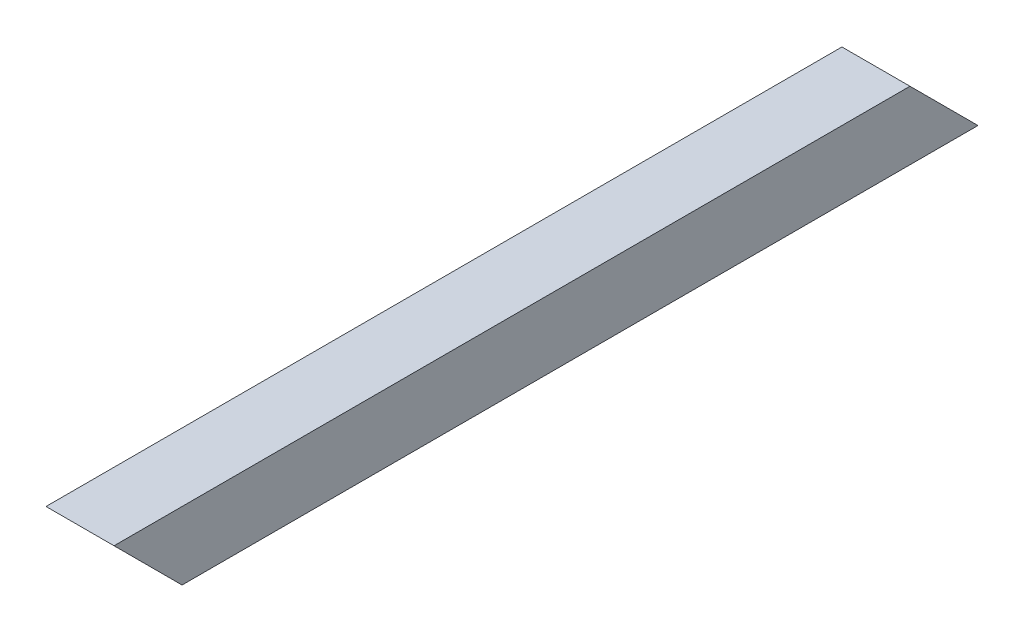
ISO-10303-21;
HEADER;
FILE_DESCRIPTION(('STEP AP214'),'2;1');
FILE_NAME('part.step','',(''),(''),'','','');
FILE_SCHEMA(('AUTOMOTIVE_DESIGN { 1 0 10303 214 1 1 1 1 }'));
ENDSEC;
DATA;
#1=APPLICATION_CONTEXT('core data for automotive mechanical design processes');
#2=APPLICATION_PROTOCOL_DEFINITION('international standard','automotive_design',2000,#1);
#3=PRODUCT_CONTEXT('',#1,'mechanical');
#4=PRODUCT('Part','Part','',(#3));
#5=PRODUCT_RELATED_PRODUCT_CATEGORY('part','',(#4));
#6=PRODUCT_DEFINITION_FORMATION('','',#4);
#7=PRODUCT_DEFINITION_CONTEXT('part definition',#1,'design');
#8=PRODUCT_DEFINITION('design','',#6,#7);
#9=PRODUCT_DEFINITION_SHAPE('','',#8);
#10=(LENGTH_UNIT() NAMED_UNIT(*) SI_UNIT(.MILLI.,.METRE.));
#11=(NAMED_UNIT(*) PLANE_ANGLE_UNIT() SI_UNIT($,.RADIAN.));
#12=(NAMED_UNIT(*) SI_UNIT($,.STERADIAN.) SOLID_ANGLE_UNIT());
#13=UNCERTAINTY_MEASURE_WITH_UNIT(LENGTH_MEASURE(1.E-05),#10,'distance_accuracy_value','');
#14=(GEOMETRIC_REPRESENTATION_CONTEXT(3) GLOBAL_UNCERTAINTY_ASSIGNED_CONTEXT((#13)) GLOBAL_UNIT_ASSIGNED_CONTEXT((#10,
#11,#12)) REPRESENTATION_CONTEXT('',''));
#15=CARTESIAN_POINT('',(0.,0.,0.));
#16=DIRECTION('',(0.,0.,1.));
#17=DIRECTION('',(1.,0.,0.));
#18=AXIS2_PLACEMENT_3D('',#15,#16,#17);
#19=CARTESIAN_POINT('',(-15.4655819438556,10.9459197691443,322.58));
#20=DIRECTION('',(1.,0.,0.));
#21=DIRECTION('',(0.,1.,0.));
#22=AXIS2_PLACEMENT_3D('',#19,#20,#21);
#23=PLANE('',#22);
#24=DIRECTION('',(0.,0.,-1.));
#25=VECTOR('',#24,1.);
#26=CARTESIAN_POINT('',(-15.4655819438556,10.9459197691443,322.58));
#27=LINE('',#26,#25);
#28=CARTESIAN_POINT('',(-15.4655819438556,10.9459197691443,322.58));
#29=VERTEX_POINT('',#28);
#30=CARTESIAN_POINT('',(-15.4655819438556,10.9459197691443,25.3999999999997));
#31=VERTEX_POINT('',#30);
#32=EDGE_CURVE('E120',#29,#31,#27,.T.);
#33=ORIENTED_EDGE('',*,*,#32,.T.);
#34=DIRECTION('',(0.,0.707106781186552,0.707106781186543));
#35=VECTOR('',#34,1.);
#36=CARTESIAN_POINT('',(-15.4655819438556,-14.4540802308557,0.));
#37=LINE('',#36,#35);
#38=CARTESIAN_POINT('',(-15.4655819438556,-14.4540802308557,0.));
#39=VERTEX_POINT('',#38);
#40=EDGE_CURVE('E47',#39,#31,#37,.T.);
#41=ORIENTED_EDGE('',*,*,#40,.F.);
#42=DIRECTION('',(0.,0.,-1.));
#43=VECTOR('',#42,1.);
#44=CARTESIAN_POINT('',(-15.4655819438556,-14.4540802308557,322.58));
#45=LINE('',#44,#43);
#46=CARTESIAN_POINT('',(-15.4655819438556,-14.4540802308557,297.18));
#47=VERTEX_POINT('',#46);
#48=EDGE_CURVE('E111',#47,#39,#45,.T.);
#49=ORIENTED_EDGE('',*,*,#48,.F.);
#50=DIRECTION('',(0.,-0.707106781186546,-0.707106781186549));
#51=VECTOR('',#50,1.);
#52=CARTESIAN_POINT('',(-15.4655819438556,10.9459197691443,322.58));
#53=LINE('',#52,#51);
#54=EDGE_CURVE('E161',#29,#47,#53,.T.);
#55=ORIENTED_EDGE('',*,*,#54,.F.);
#56=EDGE_LOOP('',(#33,#41,#49,#55));
#57=FACE_BOUND('',#56,.T.);
#58=ADVANCED_FACE('F33',(#57),#23,.F.);
#59=CARTESIAN_POINT('',(-15.4655819438556,-14.4540802308557,322.58));
#60=DIRECTION('',(0.,1.,0.));
#61=DIRECTION('',(0.,0.,1.));
#62=AXIS2_PLACEMENT_3D('',#59,#60,#61);
#63=PLANE('',#62);
#64=DIRECTION('',(0.,0.,-1.));
#65=VECTOR('',#64,1.);
#66=CARTESIAN_POINT('',(9.93441805614439,-14.4540802308557,322.58));
#67=LINE('',#66,#65);
#68=CARTESIAN_POINT('',(9.93441805614437,-14.4540802308557,297.18));
#69=VERTEX_POINT('',#68);
#70=CARTESIAN_POINT('',(9.93441805614439,-14.4540802308557,0.));
#71=VERTEX_POINT('',#70);
#72=EDGE_CURVE('E106',#69,#71,#67,.T.);
#73=ORIENTED_EDGE('',*,*,#72,.F.);
#74=DIRECTION('',(-1.,0.,0.));
#75=VECTOR('',#74,1.);
#76=CARTESIAN_POINT('',(284.254418056144,-14.4540802308556,297.18));
#77=LINE('',#76,#75);
#78=EDGE_CURVE('E149',#69,#47,#77,.T.);
#79=ORIENTED_EDGE('',*,*,#78,.T.);
#80=ORIENTED_EDGE('',*,*,#48,.T.);
#81=DIRECTION('',(1.,0.,0.));
#82=VECTOR('',#81,1.);
#83=CARTESIAN_POINT('',(-15.4655819438556,-14.4540802308557,0.));
#84=LINE('',#83,#82);
#85=EDGE_CURVE('E98',#39,#71,#84,.T.);
#86=ORIENTED_EDGE('',*,*,#85,.T.);
#87=EDGE_LOOP('',(#73,#79,#80,#86));
#88=FACE_BOUND('',#87,.T.);
#89=ADVANCED_FACE('F115',(#88),#63,.F.);
#90=CARTESIAN_POINT('',(9.93441805614439,10.9459197691443,322.58));
#91=DIRECTION('',(-1.,0.,0.));
#92=DIRECTION('',(0.,-1.,0.));
#93=AXIS2_PLACEMENT_3D('',#90,#91,#92);
#94=PLANE('',#93);
#95=ORIENTED_EDGE('',*,*,#72,.T.);
#96=DIRECTION('',(0.,0.707106781186552,0.707106781186543));
#97=VECTOR('',#96,1.);
#98=CARTESIAN_POINT('',(9.93441805614439,-14.4540802308557,0.));
#99=LINE('',#98,#97);
#100=CARTESIAN_POINT('',(9.93441805614439,10.9459197691443,25.3999999999997));
#101=VERTEX_POINT('',#100);
#102=EDGE_CURVE('E94',#71,#101,#99,.T.);
#103=ORIENTED_EDGE('',*,*,#102,.T.);
#104=DIRECTION('',(0.,0.,-1.));
#105=VECTOR('',#104,1.);
#106=CARTESIAN_POINT('',(9.93441805614439,10.9459197691443,322.58));
#107=LINE('',#106,#105);
#108=CARTESIAN_POINT('',(9.93441805614439,10.9459197691443,322.58));
#109=VERTEX_POINT('',#108);
#110=EDGE_CURVE('E112',#109,#101,#107,.T.);
#111=ORIENTED_EDGE('',*,*,#110,.F.);
#112=DIRECTION('',(0.,-0.707106781186546,-0.707106781186549));
#113=VECTOR('',#112,1.);
#114=CARTESIAN_POINT('',(9.93441805614439,10.9459197691443,322.58));
#115=LINE('',#114,#113);
#116=EDGE_CURVE('E108',#109,#69,#115,.T.);
#117=ORIENTED_EDGE('',*,*,#116,.T.);
#118=EDGE_LOOP('',(#95,#103,#111,#117));
#119=FACE_BOUND('',#118,.T.);
#120=ADVANCED_FACE('F107',(#119),#94,.F.);
#121=CARTESIAN_POINT('',(-15.4655819438556,10.9459197691443,322.58));
#122=DIRECTION('',(0.,-1.,0.));
#123=DIRECTION('',(0.,0.,-1.));
#124=AXIS2_PLACEMENT_3D('',#121,#122,#123);
#125=PLANE('',#124);
#126=ORIENTED_EDGE('',*,*,#110,.T.);
#127=DIRECTION('',(-1.,0.,0.));
#128=VECTOR('',#127,1.);
#129=CARTESIAN_POINT('',(9.93441805614439,10.9459197691443,25.3999999999997));
#130=LINE('',#129,#128);
#131=EDGE_CURVE('E99',#101,#31,#130,.T.);
#132=ORIENTED_EDGE('',*,*,#131,.T.);
#133=ORIENTED_EDGE('',*,*,#32,.F.);
#134=DIRECTION('',(-1.,0.,0.));
#135=VECTOR('',#134,1.);
#136=CARTESIAN_POINT('',(-15.4655819438556,10.9459197691443,322.58));
#137=LINE('',#136,#135);
#138=EDGE_CURVE('E117',#109,#29,#137,.T.);
#139=ORIENTED_EDGE('',*,*,#138,.F.);
#140=EDGE_LOOP('',(#126,#132,#133,#139));
#141=FACE_BOUND('',#140,.T.);
#142=ADVANCED_FACE('F171',(#141),#125,.F.);
#143=CARTESIAN_POINT('',(-12.2905819438556,7.77091976914433,322.58));
#144=DIRECTION('',(1.,0.,0.));
#145=DIRECTION('',(0.,1.,0.));
#146=AXIS2_PLACEMENT_3D('',#143,#144,#145);
#147=PLANE('',#146);
#148=DIRECTION('',(0.,-0.707106781186552,-0.707106781186543));
#149=VECTOR('',#148,1.);
#150=CARTESIAN_POINT('',(-12.2905819438556,157.948419769144,172.402499999998));
#151=LINE('',#150,#149);
#152=CARTESIAN_POINT('',(-12.2905819438556,7.77091976914433,22.2249999999997));
#153=VERTEX_POINT('',#152);
#154=CARTESIAN_POINT('',(-12.2905819438556,-11.2790802308557,3.17499999999993));
#155=VERTEX_POINT('',#154);
#156=EDGE_CURVE('E163',#153,#155,#151,.T.);
#157=ORIENTED_EDGE('',*,*,#156,.F.);
#158=DIRECTION('',(0.,0.,-1.));
#159=VECTOR('',#158,1.);
#160=CARTESIAN_POINT('',(-12.2905819438556,7.77091976914433,322.58));
#161=LINE('',#160,#159);
#162=CARTESIAN_POINT('',(-12.2905819438556,7.77091976914433,319.405));
#163=VERTEX_POINT('',#162);
#164=EDGE_CURVE('E152',#163,#153,#161,.T.);
#165=ORIENTED_EDGE('',*,*,#164,.F.);
#166=DIRECTION('',(0.,0.707106781186546,0.707106781186549));
#167=VECTOR('',#166,1.);
#168=CARTESIAN_POINT('',(-12.2905819438556,9.35841976914434,320.9925));
#169=LINE('',#168,#167);
#170=CARTESIAN_POINT('',(-12.2905819438556,-11.2790802308557,300.355));
#171=VERTEX_POINT('',#170);
#172=EDGE_CURVE('E137',#171,#163,#169,.T.);
#173=ORIENTED_EDGE('',*,*,#172,.F.);
#174=DIRECTION('',(0.,0.,-1.));
#175=VECTOR('',#174,1.);
#176=CARTESIAN_POINT('',(-12.2905819438556,-11.2790802308557,322.58));
#177=LINE('',#176,#175);
#178=EDGE_CURVE('E118',#171,#155,#177,.T.);
#179=ORIENTED_EDGE('',*,*,#178,.T.);
#180=EDGE_LOOP('',(#157,#165,#173,#179));
#181=FACE_BOUND('',#180,.T.);
#182=ADVANCED_FACE('F194',(#181),#147,.T.);
#183=CARTESIAN_POINT('',(-12.2905819438556,-11.2790802308557,322.58));
#184=DIRECTION('',(0.,1.,0.));
#185=DIRECTION('',(0.,0.,1.));
#186=AXIS2_PLACEMENT_3D('',#183,#184,#185);
#187=PLANE('',#186);
#188=DIRECTION('',(1.,0.,0.));
#189=VECTOR('',#188,1.);
#190=CARTESIAN_POINT('',(-12.2905819438557,-11.2790802308557,3.17499999999993));
#191=LINE('',#190,#189);
#192=CARTESIAN_POINT('',(6.7594180561444,-11.2790802308557,3.17500000000001));
#193=VERTEX_POINT('',#192);
#194=EDGE_CURVE('E165',#155,#193,#191,.T.);
#195=ORIENTED_EDGE('',*,*,#194,.F.);
#196=ORIENTED_EDGE('',*,*,#178,.F.);
#197=DIRECTION('',(-1.,0.,0.));
#198=VECTOR('',#197,1.);
#199=CARTESIAN_POINT('',(-12.2905819438556,-11.2790802308557,300.355));
#200=LINE('',#199,#198);
#201=CARTESIAN_POINT('',(6.7594180561444,-11.2790802308557,300.355));
#202=VERTEX_POINT('',#201);
#203=EDGE_CURVE('E148',#202,#171,#200,.T.);
#204=ORIENTED_EDGE('',*,*,#203,.F.);
#205=DIRECTION('',(0.,0.,-1.));
#206=VECTOR('',#205,1.);
#207=CARTESIAN_POINT('',(6.7594180561444,-11.2790802308557,322.58));
#208=LINE('',#207,#206);
#209=EDGE_CURVE('E123',#202,#193,#208,.T.);
#210=ORIENTED_EDGE('',*,*,#209,.T.);
#211=EDGE_LOOP('',(#195,#196,#204,#210));
#212=FACE_BOUND('',#211,.T.);
#213=ADVANCED_FACE('F197',(#212),#187,.T.);
#214=CARTESIAN_POINT('',(6.75941805614439,7.77091976914433,322.58));
#215=DIRECTION('',(-1.,0.,0.));
#216=DIRECTION('',(0.,-1.,0.));
#217=AXIS2_PLACEMENT_3D('',#214,#215,#216);
#218=PLANE('',#217);
#219=DIRECTION('',(0.,0.707106781186552,0.707106781186543));
#220=VECTOR('',#219,1.);
#221=CARTESIAN_POINT('',(6.75941805614435,157.948419769144,172.402499999998));
#222=LINE('',#221,#220);
#223=CARTESIAN_POINT('',(6.75941805614439,7.77091976914433,22.2249999999997));
#224=VERTEX_POINT('',#223);
#225=EDGE_CURVE('E54',#193,#224,#222,.T.);
#226=ORIENTED_EDGE('',*,*,#225,.F.);
#227=ORIENTED_EDGE('',*,*,#209,.F.);
#228=DIRECTION('',(0.,-0.707106781186546,-0.707106781186549));
#229=VECTOR('',#228,1.);
#230=CARTESIAN_POINT('',(6.75941805614439,9.35841976914434,320.9925));
#231=LINE('',#230,#229);
#232=CARTESIAN_POINT('',(6.75941805614439,7.77091976914433,319.405));
#233=VERTEX_POINT('',#232);
#234=EDGE_CURVE('E134',#233,#202,#231,.T.);
#235=ORIENTED_EDGE('',*,*,#234,.F.);
#236=DIRECTION('',(0.,0.,-1.));
#237=VECTOR('',#236,1.);
#238=CARTESIAN_POINT('',(6.75941805614439,7.77091976914433,322.58));
#239=LINE('',#238,#237);
#240=EDGE_CURVE('E146',#233,#224,#239,.T.);
#241=ORIENTED_EDGE('',*,*,#240,.T.);
#242=EDGE_LOOP('',(#226,#227,#235,#241));
#243=FACE_BOUND('',#242,.T.);
#244=ADVANCED_FACE('F145',(#243),#218,.T.);
#245=CARTESIAN_POINT('',(-12.2905819438556,7.77091976914433,322.58));
#246=DIRECTION('',(0.,-1.,0.));
#247=DIRECTION('',(0.,0.,-1.));
#248=AXIS2_PLACEMENT_3D('',#245,#246,#247);
#249=PLANE('',#248);
#250=DIRECTION('',(-1.,0.,0.));
#251=VECTOR('',#250,1.);
#252=CARTESIAN_POINT('',(-12.2905819438557,7.77091976914433,22.2249999999997));
#253=LINE('',#252,#251);
#254=EDGE_CURVE('E11',#224,#153,#253,.T.);
#255=ORIENTED_EDGE('',*,*,#254,.F.);
#256=ORIENTED_EDGE('',*,*,#240,.F.);
#257=DIRECTION('',(1.,0.,0.));
#258=VECTOR('',#257,1.);
#259=CARTESIAN_POINT('',(-12.2905819438556,7.77091976914433,319.405));
#260=LINE('',#259,#258);
#261=EDGE_CURVE('E40',#163,#233,#260,.T.);
#262=ORIENTED_EDGE('',*,*,#261,.F.);
#263=ORIENTED_EDGE('',*,*,#164,.T.);
#264=EDGE_LOOP('',(#255,#256,#262,#263));
#265=FACE_BOUND('',#264,.T.);
#266=ADVANCED_FACE('F151',(#265),#249,.T.);
#267=CARTESIAN_POINT('',(284.254418056144,10.9459197691444,322.58));
#268=DIRECTION('',(0.,0.707106781186549,-0.707106781186546));
#269=DIRECTION('',(0.,0.707106781186546,0.707106781186549));
#270=AXIS2_PLACEMENT_3D('',#267,#268,#269);
#271=PLANE('',#270);
#272=ORIENTED_EDGE('',*,*,#172,.T.);
#273=ORIENTED_EDGE('',*,*,#261,.T.);
#274=ORIENTED_EDGE('',*,*,#234,.T.);
#275=ORIENTED_EDGE('',*,*,#203,.T.);
#276=EDGE_LOOP('',(#272,#273,#274,#275));
#277=FACE_BOUND('',#276,.T.);
#278=ORIENTED_EDGE('',*,*,#138,.T.);
#279=ORIENTED_EDGE('',*,*,#54,.T.);
#280=ORIENTED_EDGE('',*,*,#78,.F.);
#281=ORIENTED_EDGE('',*,*,#116,.F.);
#282=EDGE_LOOP('',(#278,#279,#280,#281));
#283=FACE_BOUND('',#282,.T.);
#284=ADVANCED_FACE('F132',(#277,#283),#271,.F.);
#285=CARTESIAN_POINT('',(9.93441805614439,-14.4540802308557,0.));
#286=DIRECTION('',(0.,-0.707106781186543,0.707106781186552));
#287=DIRECTION('',(0.,-0.707106781186552,-0.707106781186543));
#288=AXIS2_PLACEMENT_3D('',#285,#286,#287);
#289=PLANE('',#288);
#290=ORIENTED_EDGE('',*,*,#156,.T.);
#291=ORIENTED_EDGE('',*,*,#194,.T.);
#292=ORIENTED_EDGE('',*,*,#225,.T.);
#293=ORIENTED_EDGE('',*,*,#254,.T.);
#294=EDGE_LOOP('',(#290,#291,#292,#293));
#295=FACE_BOUND('',#294,.T.);
#296=ORIENTED_EDGE('',*,*,#40,.T.);
#297=ORIENTED_EDGE('',*,*,#131,.F.);
#298=ORIENTED_EDGE('',*,*,#102,.F.);
#299=ORIENTED_EDGE('',*,*,#85,.F.);
#300=EDGE_LOOP('',(#296,#297,#298,#299));
#301=FACE_BOUND('',#300,.T.);
#302=ADVANCED_FACE('F96',(#295,#301),#289,.F.);
#303=CLOSED_SHELL('',(#58,#89,#120,#142,#182,#213,#244,#266,#284,#302));
#304=MANIFOLD_SOLID_BREP('B2',#303);
#305=ADVANCED_BREP_SHAPE_REPRESENTATION('',(#18,#304),#14);
#306=SHAPE_DEFINITION_REPRESENTATION(#9,#305);
ENDSEC;
END-ISO-10303-21;
